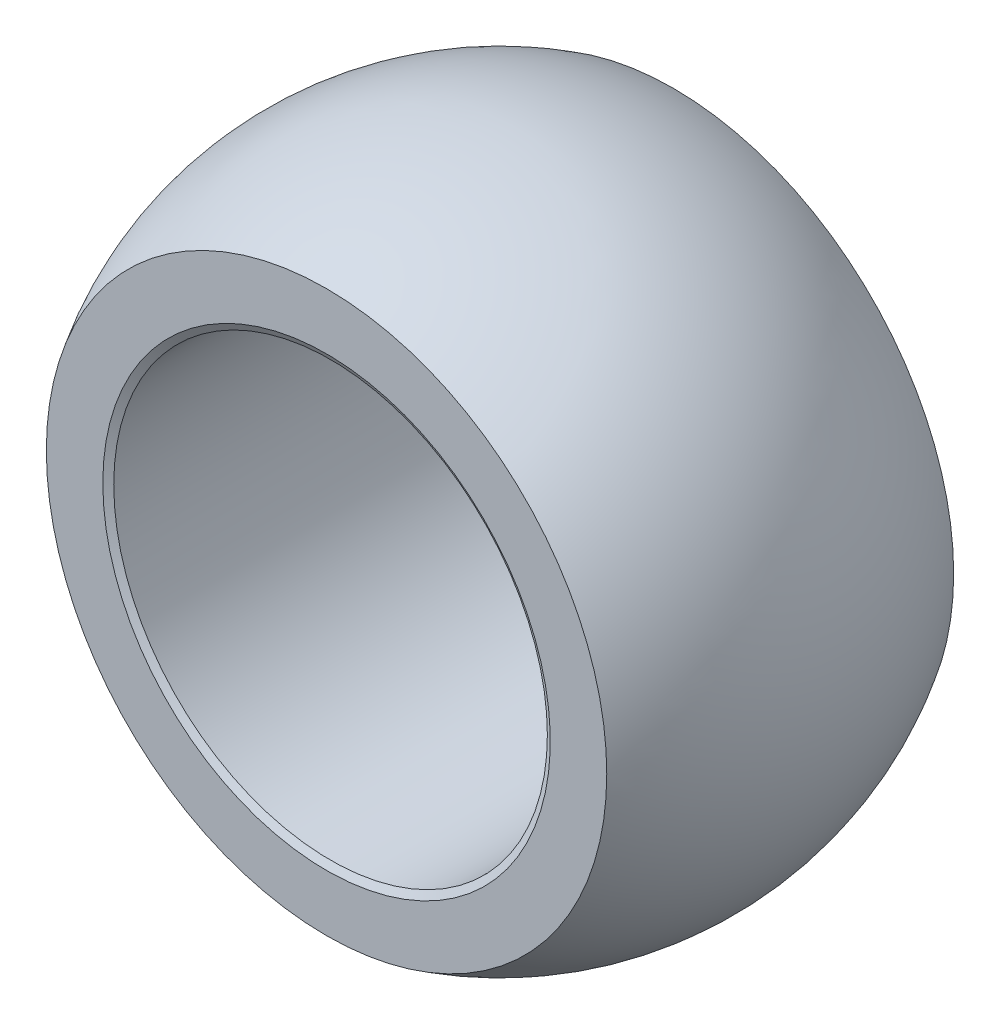
ISO-10303-21;
HEADER;
FILE_DESCRIPTION(('STEP AP214'),'2;1');
FILE_NAME('part.step','',(''),(''),'','','');
FILE_SCHEMA(('AUTOMOTIVE_DESIGN { 1 0 10303 214 1 1 1 1 }'));
ENDSEC;
DATA;
#1=APPLICATION_CONTEXT('core data for automotive mechanical design processes');
#2=APPLICATION_PROTOCOL_DEFINITION('international standard','automotive_design',2000,#1);
#3=PRODUCT_CONTEXT('',#1,'mechanical');
#4=PRODUCT('Part','Part','',(#3));
#5=PRODUCT_RELATED_PRODUCT_CATEGORY('part','',(#4));
#6=PRODUCT_DEFINITION_FORMATION('','',#4);
#7=PRODUCT_DEFINITION_CONTEXT('part definition',#1,'design');
#8=PRODUCT_DEFINITION('design','',#6,#7);
#9=PRODUCT_DEFINITION_SHAPE('','',#8);
#10=(LENGTH_UNIT() NAMED_UNIT(*) SI_UNIT(.MILLI.,.METRE.));
#11=(NAMED_UNIT(*) PLANE_ANGLE_UNIT() SI_UNIT($,.RADIAN.));
#12=(NAMED_UNIT(*) SI_UNIT($,.STERADIAN.) SOLID_ANGLE_UNIT());
#13=UNCERTAINTY_MEASURE_WITH_UNIT(LENGTH_MEASURE(1.E-05),#10,'distance_accuracy_value','');
#14=(GEOMETRIC_REPRESENTATION_CONTEXT(3) GLOBAL_UNCERTAINTY_ASSIGNED_CONTEXT((#13)) GLOBAL_UNIT_ASSIGNED_CONTEXT((#10,
#11,#12)) REPRESENTATION_CONTEXT('',''));
#15=CARTESIAN_POINT('',(0.,0.,0.));
#16=DIRECTION('',(0.,0.,1.));
#17=DIRECTION('',(1.,0.,0.));
#18=AXIS2_PLACEMENT_3D('',#15,#16,#17);
#19=CARTESIAN_POINT('',(0.,0.,0.));
#20=DIRECTION('',(0.,1.,0.));
#21=DIRECTION('',(1.,0.,0.));
#22=AXIS2_PLACEMENT_3D('',#19,#20,#21);
#23=SPHERICAL_SURFACE('',#22,12.065);
#24=CARTESIAN_POINT('',(0.,0.,0.));
#25=DIRECTION('',(0.,0.,1.));
#26=DIRECTION('',(1.,0.,0.));
#27=AXIS2_PLACEMENT_3D('',#24,#25,#26);
#28=SPHERICAL_SURFACE('',#27,12.065);
#29=CARTESIAN_POINT('',(0.,0.,-6.35));
#30=DIRECTION('',(0.,0.,1.));
#31=DIRECTION('',(1.,0.,0.));
#32=AXIS2_PLACEMENT_3D('',#29,#30,#31);
#33=CIRCLE('',#32,10.2587389575912);
#34=CARTESIAN_POINT('',(10.2587389575912,0.,-6.35));
#35=VERTEX_POINT('',#34);
#36=EDGE_CURVE('E41',#35,#35,#33,.T.);
#37=ORIENTED_EDGE('',*,*,#36,.T.);
#38=EDGE_LOOP('',(#37));
#39=FACE_BOUND('',#38,.T.);
#40=CARTESIAN_POINT('',(0.,0.,6.35));
#41=DIRECTION('',(0.,0.,-1.));
#42=DIRECTION('',(-1.,0.,0.));
#43=AXIS2_PLACEMENT_3D('',#40,#41,#42);
#44=CIRCLE('',#43,10.2587389575912);
#45=CARTESIAN_POINT('',(-10.2587389575912,0.,6.35));
#46=VERTEX_POINT('',#45);
#47=EDGE_CURVE('E45',#46,#46,#44,.T.);
#48=ORIENTED_EDGE('',*,*,#47,.T.);
#49=EDGE_LOOP('',(#48));
#50=FACE_BOUND('',#49,.T.);
#51=ADVANCED_FACE('F30',(#39,#50),#28,.T.);
#52=CARTESIAN_POINT('',(-12.065,10.2587389575912,6.35));
#53=DIRECTION('',(0.,0.,-1.));
#54=DIRECTION('',(-1.,0.,0.));
#55=AXIS2_PLACEMENT_3D('',#52,#53,#54);
#56=PLANE('',#55);
#57=CARTESIAN_POINT('',(0.,0.,6.35));
#58=DIRECTION('',(0.,0.,-1.));
#59=DIRECTION('',(-1.,0.,0.));
#60=AXIS2_PLACEMENT_3D('',#57,#58,#59);
#61=CIRCLE('',#60,8.1915);
#62=CARTESIAN_POINT('',(-8.1915,0.,6.35));
#63=VERTEX_POINT('',#62);
#64=EDGE_CURVE('E10',#63,#63,#61,.T.);
#65=ORIENTED_EDGE('',*,*,#64,.T.);
#66=EDGE_LOOP('',(#65));
#67=FACE_BOUND('',#66,.T.);
#68=ORIENTED_EDGE('',*,*,#47,.F.);
#69=EDGE_LOOP('',(#68));
#70=FACE_BOUND('',#69,.T.);
#71=ADVANCED_FACE('F65',(#67,#70),#56,.F.);
#72=CARTESIAN_POINT('',(-12.065,10.2587389575912,-6.35));
#73=DIRECTION('',(0.,0.,1.));
#74=DIRECTION('',(1.,0.,0.));
#75=AXIS2_PLACEMENT_3D('',#72,#73,#74);
#76=PLANE('',#75);
#77=CARTESIAN_POINT('',(0.,0.,-6.35));
#78=DIRECTION('',(0.,0.,1.));
#79=DIRECTION('',(1.,0.,0.));
#80=AXIS2_PLACEMENT_3D('',#77,#78,#79);
#81=CIRCLE('',#80,7.9375);
#82=CARTESIAN_POINT('',(7.9375,0.,-6.35));
#83=VERTEX_POINT('',#82);
#84=EDGE_CURVE('E50',#83,#83,#81,.T.);
#85=ORIENTED_EDGE('',*,*,#84,.T.);
#86=EDGE_LOOP('',(#85));
#87=FACE_BOUND('',#86,.T.);
#88=ORIENTED_EDGE('',*,*,#36,.F.);
#89=EDGE_LOOP('',(#88));
#90=FACE_BOUND('',#89,.T.);
#91=ADVANCED_FACE('F54',(#87,#90),#76,.F.);
#92=CARTESIAN_POINT('',(0.,0.,-6.35));
#93=DIRECTION('',(0.,0.,1.));
#94=DIRECTION('',(1.,0.,0.));
#95=AXIS2_PLACEMENT_3D('',#92,#93,#94);
#96=CYLINDRICAL_SURFACE('',#95,7.9375);
#97=CARTESIAN_POINT('',(0.,0.,6.20335303162584));
#98=DIRECTION('',(0.,0.,-1.));
#99=DIRECTION('',(-1.,0.,0.));
#100=AXIS2_PLACEMENT_3D('',#97,#98,#99);
#101=CIRCLE('',#100,7.9375);
#102=CARTESIAN_POINT('',(-7.9375,0.,6.20335303162584));
#103=VERTEX_POINT('',#102);
#104=EDGE_CURVE('E37',#103,#103,#101,.F.);
#105=ORIENTED_EDGE('',*,*,#104,.T.);
#106=EDGE_LOOP('',(#105));
#107=FACE_BOUND('',#106,.T.);
#108=ORIENTED_EDGE('',*,*,#84,.F.);
#109=EDGE_LOOP('',(#108));
#110=FACE_BOUND('',#109,.T.);
#111=ADVANCED_FACE('F57',(#107,#110),#96,.F.);
#112=CARTESIAN_POINT('',(0.,0.,6.20335303162584));
#113=DIRECTION('',(0.,0.,1.));
#114=DIRECTION('',(1.,0.,0.));
#115=AXIS2_PLACEMENT_3D('',#112,#113,#114);
#116=CONICAL_SURFACE('',#115,7.9375,1.04719755119661);
#117=ORIENTED_EDGE('',*,*,#64,.F.);
#118=EDGE_LOOP('',(#117));
#119=FACE_BOUND('',#118,.T.);
#120=ORIENTED_EDGE('',*,*,#104,.F.);
#121=EDGE_LOOP('',(#120));
#122=FACE_BOUND('',#121,.T.);
#123=ADVANCED_FACE('F32',(#119,#122),#116,.F.);
#124=CLOSED_SHELL('',(#51,#71,#91,#111,#123));
#125=MANIFOLD_SOLID_BREP('B2',#124);
#126=ADVANCED_BREP_SHAPE_REPRESENTATION('',(#18,#125),#14);
#127=SHAPE_DEFINITION_REPRESENTATION(#9,#126);
ENDSEC;
END-ISO-10303-21;
